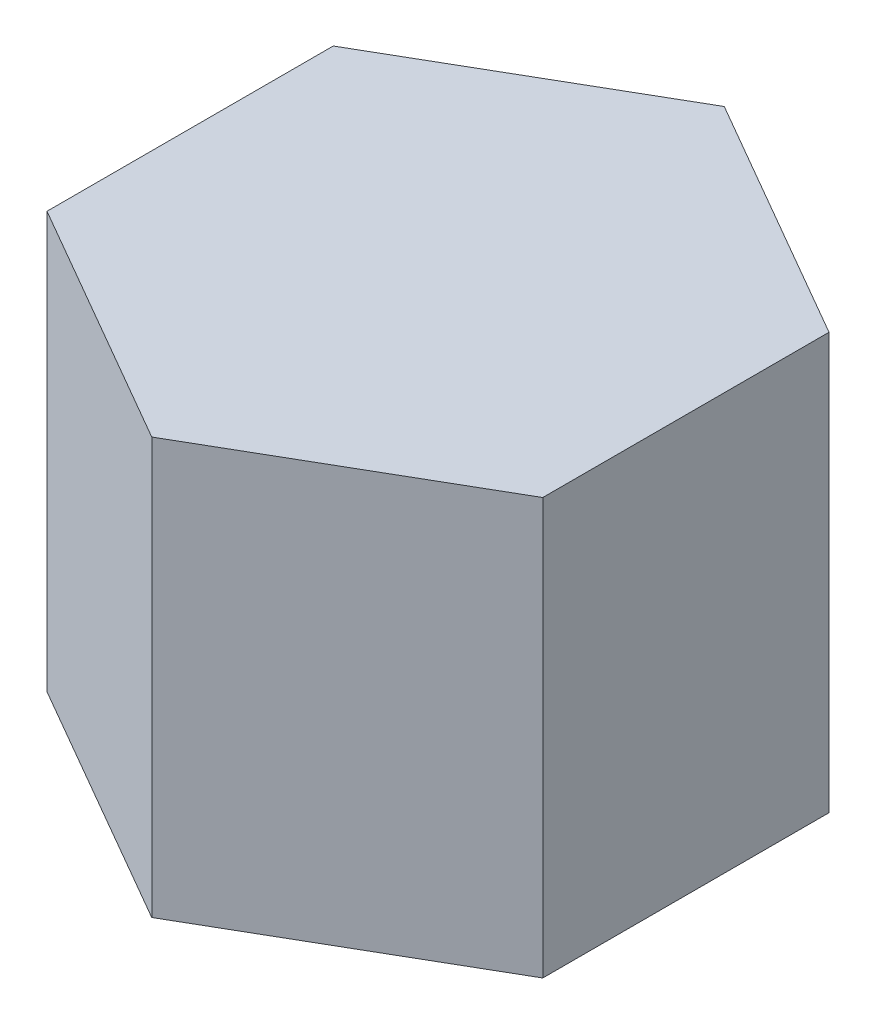
ISO-10303-21;
HEADER;
FILE_DESCRIPTION(('STEP AP214'),'2;1');
FILE_NAME('part.step','',(''),(''),'','','');
FILE_SCHEMA(('AUTOMOTIVE_DESIGN { 1 0 10303 214 1 1 1 1 }'));
ENDSEC;
DATA;
#1=APPLICATION_CONTEXT('core data for automotive mechanical design processes');
#2=APPLICATION_PROTOCOL_DEFINITION('international standard','automotive_design',2000,#1);
#3=PRODUCT_CONTEXT('',#1,'mechanical');
#4=PRODUCT('Part','Part','',(#3));
#5=PRODUCT_RELATED_PRODUCT_CATEGORY('part','',(#4));
#6=PRODUCT_DEFINITION_FORMATION('','',#4);
#7=PRODUCT_DEFINITION_CONTEXT('part definition',#1,'design');
#8=PRODUCT_DEFINITION('design','',#6,#7);
#9=PRODUCT_DEFINITION_SHAPE('','',#8);
#10=(LENGTH_UNIT() NAMED_UNIT(*) SI_UNIT(.MILLI.,.METRE.));
#11=(NAMED_UNIT(*) PLANE_ANGLE_UNIT() SI_UNIT($,.RADIAN.));
#12=(NAMED_UNIT(*) SI_UNIT($,.STERADIAN.) SOLID_ANGLE_UNIT());
#13=UNCERTAINTY_MEASURE_WITH_UNIT(LENGTH_MEASURE(1.E-05),#10,'distance_accuracy_value','');
#14=(GEOMETRIC_REPRESENTATION_CONTEXT(3) GLOBAL_UNCERTAINTY_ASSIGNED_CONTEXT((#13)) GLOBAL_UNIT_ASSIGNED_CONTEXT((#10,
#11,#12)) REPRESENTATION_CONTEXT('',''));
#15=CARTESIAN_POINT('',(0.,0.,0.));
#16=DIRECTION('',(0.,0.,1.));
#17=DIRECTION('',(1.,0.,0.));
#18=AXIS2_PLACEMENT_3D('',#15,#16,#17);
#19=CARTESIAN_POINT('',(208.339551417381,-147.556598747966,295.146072835632));
#20=DIRECTION('',(-0.500000000000062,0.,-0.866025403784403));
#21=DIRECTION('',(-0.866025403784403,0.,0.500000000000062));
#22=AXIS2_PLACEMENT_3D('',#19,#20,#21);
#23=PLANE('',#22);
#24=CARTESIAN_POINT('',(208.642660308706,-147.047793579175,294.971072835632));
#25=DIRECTION('',(-0.866025403784403,0.,0.500000000000062));
#26=VECTOR('',#25,1.);
#27=LINE('',#24,#26);
#28=CARTESIAN_POINT('',(208.642660308706,-147.047793579175,294.971072835632));
#29=VERTEX_POINT('',#28);
#30=CARTESIAN_POINT('',(208.339551417382,-147.047793579175,295.146072835632));
#31=VERTEX_POINT('',#30);
#32=EDGE_CURVE('E170',#29,#31,#27,.T.);
#33=ORIENTED_EDGE('',*,*,#32,.T.);
#34=CARTESIAN_POINT('',(208.339551417382,-147.556598747966,295.146072835632));
#35=DIRECTION('',(0.,1.,0.));
#36=VECTOR('',#35,1.);
#37=LINE('',#34,#36);
#38=CARTESIAN_POINT('',(208.339551417382,-147.556598747966,295.146072835632));
#39=VERTEX_POINT('',#38);
#40=EDGE_CURVE('E35',#39,#31,#37,.T.);
#41=ORIENTED_EDGE('',*,*,#40,.F.);
#42=CARTESIAN_POINT('',(208.642660308706,-147.556598747966,294.971072835632));
#43=DIRECTION('',(-0.866025403784403,0.,0.500000000000062));
#44=VECTOR('',#43,1.);
#45=LINE('',#42,#44);
#46=CARTESIAN_POINT('',(208.642660308706,-147.556598747966,294.971072835632));
#47=VERTEX_POINT('',#46);
#48=EDGE_CURVE('E159',#47,#39,#45,.T.);
#49=ORIENTED_EDGE('',*,*,#48,.F.);
#50=CARTESIAN_POINT('',(208.642660308706,-147.556598747966,294.971072835632));
#51=DIRECTION('',(0.,1.,0.));
#52=VECTOR('',#51,1.);
#53=LINE('',#50,#52);
#54=EDGE_CURVE('E10',#47,#29,#53,.T.);
#55=ORIENTED_EDGE('',*,*,#54,.T.);
#56=EDGE_LOOP('',(#33,#41,#49,#55));
#57=FACE_BOUND('',#56,.T.);
#58=ADVANCED_FACE('F16',(#57),#23,.F.);
#59=CARTESIAN_POINT('',(208.642660308706,-147.556598747966,291.594471220494));
#60=DIRECTION('',(-1.,0.,0.));
#61=DIRECTION('',(0.,-1.,0.));
#62=AXIS2_PLACEMENT_3D('',#59,#60,#61);
#63=PLANE('',#62);
#64=CARTESIAN_POINT('',(208.642660308706,-147.047793579175,294.621072835632));
#65=DIRECTION('',(0.,0.,1.));
#66=VECTOR('',#65,1.);
#67=LINE('',#64,#66);
#68=CARTESIAN_POINT('',(208.642660308706,-147.047793579175,294.621072835632));
#69=VERTEX_POINT('',#68);
#70=EDGE_CURVE('E167',#69,#29,#67,.T.);
#71=ORIENTED_EDGE('',*,*,#70,.T.);
#72=ORIENTED_EDGE('',*,*,#54,.F.);
#73=CARTESIAN_POINT('',(208.642660308706,-147.556598747966,294.621072835632));
#74=DIRECTION('',(0.,0.,1.));
#75=VECTOR('',#74,1.);
#76=LINE('',#73,#75);
#77=CARTESIAN_POINT('',(208.642660308706,-147.556598747966,294.621072835632));
#78=VERTEX_POINT('',#77);
#79=EDGE_CURVE('E156',#78,#47,#76,.T.);
#80=ORIENTED_EDGE('',*,*,#79,.F.);
#81=CARTESIAN_POINT('',(208.642660308706,-147.556598747966,294.621072835632));
#82=DIRECTION('',(0.,1.,0.));
#83=VECTOR('',#82,1.);
#84=LINE('',#81,#83);
#85=EDGE_CURVE('E27',#78,#69,#84,.T.);
#86=ORIENTED_EDGE('',*,*,#85,.T.);
#87=EDGE_LOOP('',(#71,#72,#80,#86));
#88=FACE_BOUND('',#87,.T.);
#89=ADVANCED_FACE('F189',(#88),#63,.F.);
#90=CARTESIAN_POINT('',(208.642660308706,-147.556598747966,294.621072835632));
#91=DIRECTION('',(-0.500000000000096,0.,0.866025403784383));
#92=DIRECTION('',(0.866025403784383,0.,0.500000000000096));
#93=AXIS2_PLACEMENT_3D('',#90,#91,#92);
#94=PLANE('',#93);
#95=CARTESIAN_POINT('',(208.339551417382,-147.047793579175,294.446072835632));
#96=DIRECTION('',(0.866025403784383,0.,0.500000000000096));
#97=VECTOR('',#96,1.);
#98=LINE('',#95,#97);
#99=CARTESIAN_POINT('',(208.339551417382,-147.047793579175,294.446072835632));
#100=VERTEX_POINT('',#99);
#101=EDGE_CURVE('E163',#100,#69,#98,.T.);
#102=ORIENTED_EDGE('',*,*,#101,.T.);
#103=ORIENTED_EDGE('',*,*,#85,.F.);
#104=CARTESIAN_POINT('',(208.339551417382,-147.556598747966,294.446072835632));
#105=DIRECTION('',(0.866025403784383,0.,0.500000000000096));
#106=VECTOR('',#105,1.);
#107=LINE('',#104,#106);
#108=CARTESIAN_POINT('',(208.339551417382,-147.556598747966,294.446072835632));
#109=VERTEX_POINT('',#108);
#110=EDGE_CURVE('E106',#109,#78,#107,.T.);
#111=ORIENTED_EDGE('',*,*,#110,.F.);
#112=CARTESIAN_POINT('',(208.339551417382,-147.556598747966,294.446072835632));
#113=DIRECTION('',(0.,1.,0.));
#114=VECTOR('',#113,1.);
#115=LINE('',#112,#114);
#116=EDGE_CURVE('E94',#109,#100,#115,.T.);
#117=ORIENTED_EDGE('',*,*,#116,.T.);
#118=EDGE_LOOP('',(#102,#103,#111,#117));
#119=FACE_BOUND('',#118,.T.);
#120=ADVANCED_FACE('F198',(#119),#94,.F.);
#121=CARTESIAN_POINT('',(208.339551417382,-147.556598747966,294.446072835632));
#122=DIRECTION('',(0.499999999999978,0.,0.866025403784452));
#123=DIRECTION('',(0.866025403784452,0.,-0.499999999999978));
#124=AXIS2_PLACEMENT_3D('',#121,#122,#123);
#125=PLANE('',#124);
#126=CARTESIAN_POINT('',(208.036442526057,-147.047793579175,294.621072835632));
#127=DIRECTION('',(0.866025403784452,0.,-0.499999999999978));
#128=VECTOR('',#127,1.);
#129=LINE('',#126,#128);
#130=CARTESIAN_POINT('',(208.036442526057,-147.047793579175,294.621072835632));
#131=VERTEX_POINT('',#130);
#132=EDGE_CURVE('E162',#131,#100,#129,.T.);
#133=ORIENTED_EDGE('',*,*,#132,.T.);
#134=ORIENTED_EDGE('',*,*,#116,.F.);
#135=CARTESIAN_POINT('',(208.036442526057,-147.556598747966,294.621072835632));
#136=DIRECTION('',(0.866025403784452,0.,-0.499999999999978));
#137=VECTOR('',#136,1.);
#138=LINE('',#135,#137);
#139=CARTESIAN_POINT('',(208.036442526057,-147.556598747966,294.621072835632));
#140=VERTEX_POINT('',#139);
#141=EDGE_CURVE('E98',#140,#109,#138,.T.);
#142=ORIENTED_EDGE('',*,*,#141,.F.);
#143=CARTESIAN_POINT('',(208.036442526057,-147.556598747966,294.621072835632));
#144=DIRECTION('',(0.,1.,0.));
#145=VECTOR('',#144,1.);
#146=LINE('',#143,#145);
#147=EDGE_CURVE('E79',#140,#131,#146,.T.);
#148=ORIENTED_EDGE('',*,*,#147,.T.);
#149=EDGE_LOOP('',(#133,#134,#142,#148));
#150=FACE_BOUND('',#149,.T.);
#151=ADVANCED_FACE('F100',(#150),#125,.F.);
#152=CARTESIAN_POINT('',(208.036442526057,-147.556598747966,291.594471220494));
#153=DIRECTION('',(1.,0.,0.));
#154=DIRECTION('',(0.,1.,0.));
#155=AXIS2_PLACEMENT_3D('',#152,#153,#154);
#156=PLANE('',#155);
#157=CARTESIAN_POINT('',(208.036442526057,-147.047793579175,294.971072835632));
#158=DIRECTION('',(0.,0.,-1.));
#159=VECTOR('',#158,1.);
#160=LINE('',#157,#159);
#161=CARTESIAN_POINT('',(208.036442526057,-147.047793579175,294.971072835632));
#162=VERTEX_POINT('',#161);
#163=EDGE_CURVE('E88',#162,#131,#160,.T.);
#164=ORIENTED_EDGE('',*,*,#163,.T.);
#165=ORIENTED_EDGE('',*,*,#147,.F.);
#166=CARTESIAN_POINT('',(208.036442526057,-147.556598747966,294.971072835632));
#167=DIRECTION('',(0.,0.,-1.));
#168=VECTOR('',#167,1.);
#169=LINE('',#166,#168);
#170=CARTESIAN_POINT('',(208.036442526057,-147.556598747966,294.971072835632));
#171=VERTEX_POINT('',#170);
#172=EDGE_CURVE('E84',#171,#140,#169,.T.);
#173=ORIENTED_EDGE('',*,*,#172,.F.);
#174=CARTESIAN_POINT('',(208.036442526057,-147.556598747966,294.971072835632));
#175=DIRECTION('',(0.,1.,0.));
#176=VECTOR('',#175,1.);
#177=LINE('',#174,#176);
#178=EDGE_CURVE('E58',#171,#162,#177,.T.);
#179=ORIENTED_EDGE('',*,*,#178,.T.);
#180=EDGE_LOOP('',(#164,#165,#173,#179));
#181=FACE_BOUND('',#180,.T.);
#182=ADVANCED_FACE('F82',(#181),#156,.F.);
#183=CARTESIAN_POINT('',(208.036442526057,-147.556598747966,294.971072835632));
#184=DIRECTION('',(0.500000000000062,0.,-0.866025403784403));
#185=DIRECTION('',(-0.866025403784403,0.,-0.500000000000062));
#186=AXIS2_PLACEMENT_3D('',#183,#184,#185);
#187=PLANE('',#186);
#188=CARTESIAN_POINT('',(208.339551417382,-147.047793579175,295.146072835632));
#189=DIRECTION('',(-0.866025403784403,0.,-0.500000000000062));
#190=VECTOR('',#189,1.);
#191=LINE('',#188,#190);
#192=EDGE_CURVE('E160',#31,#162,#191,.T.);
#193=ORIENTED_EDGE('',*,*,#192,.T.);
#194=ORIENTED_EDGE('',*,*,#178,.F.);
#195=CARTESIAN_POINT('',(208.339551417382,-147.556598747966,295.146072835632));
#196=DIRECTION('',(-0.866025403784403,0.,-0.500000000000062));
#197=VECTOR('',#196,1.);
#198=LINE('',#195,#197);
#199=EDGE_CURVE('E112',#39,#171,#198,.T.);
#200=ORIENTED_EDGE('',*,*,#199,.F.);
#201=ORIENTED_EDGE('',*,*,#40,.T.);
#202=EDGE_LOOP('',(#193,#194,#200,#201));
#203=FACE_BOUND('',#202,.T.);
#204=ADVANCED_FACE('F131',(#203),#187,.F.);
#205=CARTESIAN_POINT('',(206.491105863044,-147.556598747966,291.594471220494));
#206=DIRECTION('',(0.,1.,0.));
#207=DIRECTION('',(-1.,0.,0.));
#208=AXIS2_PLACEMENT_3D('',#205,#206,#207);
#209=PLANE('',#208);
#210=ORIENTED_EDGE('',*,*,#48,.T.);
#211=ORIENTED_EDGE('',*,*,#199,.T.);
#212=ORIENTED_EDGE('',*,*,#172,.T.);
#213=ORIENTED_EDGE('',*,*,#141,.T.);
#214=ORIENTED_EDGE('',*,*,#110,.T.);
#215=ORIENTED_EDGE('',*,*,#79,.T.);
#216=EDGE_LOOP('',(#210,#211,#212,#213,#214,#215));
#217=FACE_BOUND('',#216,.T.);
#218=ADVANCED_FACE('F111',(#217),#209,.F.);
#219=CARTESIAN_POINT('',(206.491105863044,-147.047793579175,291.594471220494));
#220=DIRECTION('',(0.,1.,0.));
#221=DIRECTION('',(-1.,0.,0.));
#222=AXIS2_PLACEMENT_3D('',#219,#220,#221);
#223=PLANE('',#222);
#224=ORIENTED_EDGE('',*,*,#32,.F.);
#225=ORIENTED_EDGE('',*,*,#70,.F.);
#226=ORIENTED_EDGE('',*,*,#101,.F.);
#227=ORIENTED_EDGE('',*,*,#132,.F.);
#228=ORIENTED_EDGE('',*,*,#163,.F.);
#229=ORIENTED_EDGE('',*,*,#192,.F.);
#230=EDGE_LOOP('',(#224,#225,#226,#227,#228,#229));
#231=FACE_BOUND('',#230,.T.);
#232=ADVANCED_FACE('F130',(#231),#223,.T.);
#233=CLOSED_SHELL('',(#58,#89,#120,#151,#182,#204,#218,#232));
#234=MANIFOLD_SOLID_BREP('B1',#233);
#235=ADVANCED_BREP_SHAPE_REPRESENTATION('',(#18,#234),#14);
#236=SHAPE_DEFINITION_REPRESENTATION(#9,#235);
ENDSEC;
END-ISO-10303-21;
